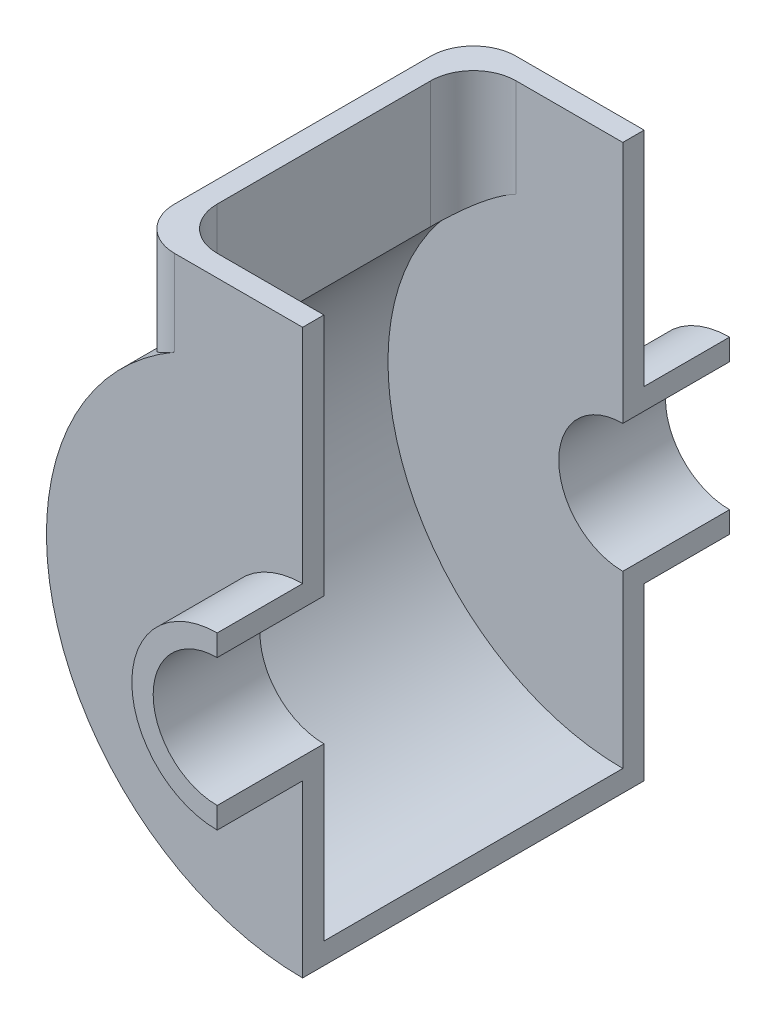
ISO-10303-21;
HEADER;
FILE_DESCRIPTION(('STEP AP214'),'2;1');
FILE_NAME('part.step','',(''),(''),'','','');
FILE_SCHEMA(('AUTOMOTIVE_DESIGN { 1 0 10303 214 1 1 1 1 }'));
ENDSEC;
DATA;
#1=APPLICATION_CONTEXT('core data for automotive mechanical design processes');
#2=APPLICATION_PROTOCOL_DEFINITION('international standard','automotive_design',2000,#1);
#3=PRODUCT_CONTEXT('',#1,'mechanical');
#4=PRODUCT('Part','Part','',(#3));
#5=PRODUCT_RELATED_PRODUCT_CATEGORY('part','',(#4));
#6=PRODUCT_DEFINITION_FORMATION('','',#4);
#7=PRODUCT_DEFINITION_CONTEXT('part definition',#1,'design');
#8=PRODUCT_DEFINITION('design','',#6,#7);
#9=PRODUCT_DEFINITION_SHAPE('','',#8);
#10=(LENGTH_UNIT() NAMED_UNIT(*) SI_UNIT(.MILLI.,.METRE.));
#11=(NAMED_UNIT(*) PLANE_ANGLE_UNIT() SI_UNIT($,.RADIAN.));
#12=(NAMED_UNIT(*) SI_UNIT($,.STERADIAN.) SOLID_ANGLE_UNIT());
#13=UNCERTAINTY_MEASURE_WITH_UNIT(LENGTH_MEASURE(1.E-05),#10,'distance_accuracy_value','');
#14=(GEOMETRIC_REPRESENTATION_CONTEXT(3) GLOBAL_UNCERTAINTY_ASSIGNED_CONTEXT((#13)) GLOBAL_UNIT_ASSIGNED_CONTEXT((#10,
#11,#12)) REPRESENTATION_CONTEXT('',''));
#15=CARTESIAN_POINT('',(0.,0.,0.));
#16=DIRECTION('',(0.,0.,1.));
#17=DIRECTION('',(1.,0.,0.));
#18=AXIS2_PLACEMENT_3D('',#15,#16,#17);
#19=CARTESIAN_POINT('',(0.,0.,0.));
#20=DIRECTION('',(0.,0.,1.));
#21=DIRECTION('',(1.,0.,0.));
#22=AXIS2_PLACEMENT_3D('',#19,#20,#21);
#23=PLANE('',#22);
#24=CARTESIAN_POINT('',(0.,0.,0.));
#25=DIRECTION('',(0.,0.,1.));
#26=DIRECTION('',(1.,0.,0.));
#27=AXIS2_PLACEMENT_3D('',#24,#25,#26);
#28=CIRCLE('',#27,55.);
#29=CARTESIAN_POINT('',(-25.,48.9897948556636,0.));
#30=VERTEX_POINT('',#29);
#31=CARTESIAN_POINT('',(0.,-55.,0.));
#32=VERTEX_POINT('',#31);
#33=EDGE_CURVE('E71',#30,#32,#28,.T.);
#34=ORIENTED_EDGE('',*,*,#33,.F.);
#35=DIRECTION('',(0.,-1.,0.));
#36=VECTOR('',#35,1.);
#37=CARTESIAN_POINT('',(-25.,72.,0.));
#38=LINE('',#37,#36);
#39=CARTESIAN_POINT('',(-25.,72.,0.));
#40=VERTEX_POINT('',#39);
#41=EDGE_CURVE('E328',#30,#40,#38,.F.);
#42=ORIENTED_EDGE('',*,*,#41,.T.);
#43=DIRECTION('',(-1.,0.,0.));
#44=VECTOR('',#43,1.);
#45=CARTESIAN_POINT('',(0.,72.,0.));
#46=LINE('',#45,#44);
#47=CARTESIAN_POINT('',(0.,72.,0.));
#48=VERTEX_POINT('',#47);
#49=EDGE_CURVE('E265',#48,#40,#46,.T.);
#50=ORIENTED_EDGE('',*,*,#49,.F.);
#51=DIRECTION('',(0.,1.,0.));
#52=VECTOR('',#51,1.);
#53=CARTESIAN_POINT('',(0.,20.,0.));
#54=LINE('',#53,#52);
#55=CARTESIAN_POINT('',(0.,15.,0.));
#56=VERTEX_POINT('',#55);
#57=EDGE_CURVE('E298',#56,#48,#54,.T.);
#58=ORIENTED_EDGE('',*,*,#57,.F.);
#59=CARTESIAN_POINT('',(0.,0.,0.));
#60=DIRECTION('',(0.,0.,-1.));
#61=DIRECTION('',(1.,0.,0.));
#62=AXIS2_PLACEMENT_3D('',#59,#60,#61);
#63=CIRCLE('',#62,15.);
#64=CARTESIAN_POINT('',(0.,-15.,0.));
#65=VERTEX_POINT('',#64);
#66=EDGE_CURVE('E284',#65,#56,#63,.T.);
#67=ORIENTED_EDGE('',*,*,#66,.F.);
#68=DIRECTION('',(0.,1.,0.));
#69=VECTOR('',#68,1.);
#70=CARTESIAN_POINT('',(0.,-15.,0.));
#71=LINE('',#70,#69);
#72=EDGE_CURVE('E289',#32,#65,#71,.T.);
#73=ORIENTED_EDGE('',*,*,#72,.F.);
#74=EDGE_LOOP('',(#34,#42,#50,#58,#67,#73));
#75=FACE_BOUND('',#74,.T.);
#76=ADVANCED_FACE('F43',(#75),#23,.F.);
#77=CARTESIAN_POINT('',(0.,0.,25.));
#78=DIRECTION('',(0.,0.,-1.));
#79=DIRECTION('',(-1.,0.,0.));
#80=AXIS2_PLACEMENT_3D('',#77,#78,#79);
#81=CYLINDRICAL_SURFACE('',#80,20.);
#82=CARTESIAN_POINT('',(0.,0.,5.));
#83=DIRECTION('',(0.,0.,-1.));
#84=DIRECTION('',(-1.,0.,0.));
#85=AXIS2_PLACEMENT_3D('',#82,#83,#84);
#86=CIRCLE('',#85,20.);
#87=CARTESIAN_POINT('',(0.,-20.,5.));
#88=VERTEX_POINT('',#87);
#89=CARTESIAN_POINT('',(0.,20.,5.));
#90=VERTEX_POINT('',#89);
#91=EDGE_CURVE('E281',#88,#90,#86,.T.);
#92=ORIENTED_EDGE('',*,*,#91,.F.);
#93=DIRECTION('',(0.,0.,-1.));
#94=VECTOR('',#93,1.);
#95=CARTESIAN_POINT('',(0.,-20.,25.));
#96=LINE('',#95,#94);
#97=CARTESIAN_POINT('',(0.,-20.,25.));
#98=VERTEX_POINT('',#97);
#99=EDGE_CURVE('E303',#98,#88,#96,.T.);
#100=ORIENTED_EDGE('',*,*,#99,.F.);
#101=CARTESIAN_POINT('',(0.,0.,25.));
#102=DIRECTION('',(0.,0.,1.));
#103=DIRECTION('',(1.,0.,0.));
#104=AXIS2_PLACEMENT_3D('',#101,#102,#103);
#105=CIRCLE('',#104,20.);
#106=CARTESIAN_POINT('',(0.,20.,25.));
#107=VERTEX_POINT('',#106);
#108=EDGE_CURVE('E291',#107,#98,#105,.T.);
#109=ORIENTED_EDGE('',*,*,#108,.F.);
#110=DIRECTION('',(0.,0.,-1.));
#111=VECTOR('',#110,1.);
#112=CARTESIAN_POINT('',(0.,20.,25.));
#113=LINE('',#112,#111);
#114=EDGE_CURVE('E305',#107,#90,#113,.T.);
#115=ORIENTED_EDGE('',*,*,#114,.T.);
#116=EDGE_LOOP('',(#92,#100,#109,#115));
#117=FACE_BOUND('',#116,.T.);
#118=ADVANCED_FACE('F397',(#117),#81,.T.);
#119=CARTESIAN_POINT('',(0.,0.,25.));
#120=DIRECTION('',(0.,0.,-1.));
#121=DIRECTION('',(-1.,0.,0.));
#122=AXIS2_PLACEMENT_3D('',#119,#120,#121);
#123=CYLINDRICAL_SURFACE('',#122,15.);
#124=ORIENTED_EDGE('',*,*,#66,.T.);
#125=DIRECTION('',(0.,0.,-1.));
#126=VECTOR('',#125,1.);
#127=CARTESIAN_POINT('',(0.,15.,25.));
#128=LINE('',#127,#126);
#129=CARTESIAN_POINT('',(0.,15.,25.));
#130=VERTEX_POINT('',#129);
#131=EDGE_CURVE('E307',#130,#56,#128,.T.);
#132=ORIENTED_EDGE('',*,*,#131,.F.);
#133=CARTESIAN_POINT('',(0.,0.,25.));
#134=DIRECTION('',(0.,0.,-1.));
#135=DIRECTION('',(1.,0.,0.));
#136=AXIS2_PLACEMENT_3D('',#133,#134,#135);
#137=CIRCLE('',#136,15.);
#138=CARTESIAN_POINT('',(0.,-15.,25.));
#139=VERTEX_POINT('',#138);
#140=EDGE_CURVE('E285',#139,#130,#137,.T.);
#141=ORIENTED_EDGE('',*,*,#140,.F.);
#142=DIRECTION('',(0.,0.,-1.));
#143=VECTOR('',#142,1.);
#144=CARTESIAN_POINT('',(0.,-15.,25.));
#145=LINE('',#144,#143);
#146=EDGE_CURVE('E295',#139,#65,#145,.T.);
#147=ORIENTED_EDGE('',*,*,#146,.T.);
#148=EDGE_LOOP('',(#124,#132,#141,#147));
#149=FACE_BOUND('',#148,.T.);
#150=ADVANCED_FACE('F356',(#149),#123,.F.);
#151=CARTESIAN_POINT('',(0.,20.,25.));
#152=DIRECTION('',(-1.,0.,0.));
#153=DIRECTION('',(0.,-1.,0.));
#154=AXIS2_PLACEMENT_3D('',#151,#152,#153);
#155=PLANE('',#154);
#156=ORIENTED_EDGE('',*,*,#57,.T.);
#157=DIRECTION('',(0.,0.,-1.));
#158=VECTOR('',#157,1.);
#159=CARTESIAN_POINT('',(0.,72.,5.));
#160=LINE('',#159,#158);
#161=CARTESIAN_POINT('',(0.,72.,5.));
#162=VERTEX_POINT('',#161);
#163=EDGE_CURVE('E195',#162,#48,#160,.T.);
#164=ORIENTED_EDGE('',*,*,#163,.F.);
#165=DIRECTION('',(0.,1.,0.));
#166=VECTOR('',#165,1.);
#167=CARTESIAN_POINT('',(0.,15.,5.));
#168=LINE('',#167,#166);
#169=EDGE_CURVE('E271',#90,#162,#168,.T.);
#170=ORIENTED_EDGE('',*,*,#169,.F.);
#171=ORIENTED_EDGE('',*,*,#114,.F.);
#172=DIRECTION('',(0.,1.,0.));
#173=VECTOR('',#172,1.);
#174=CARTESIAN_POINT('',(0.,20.,25.));
#175=LINE('',#174,#173);
#176=EDGE_CURVE('E288',#130,#107,#175,.T.);
#177=ORIENTED_EDGE('',*,*,#176,.F.);
#178=ORIENTED_EDGE('',*,*,#131,.T.);
#179=EDGE_LOOP('',(#156,#164,#170,#171,#177,#178));
#180=FACE_BOUND('',#179,.T.);
#181=ADVANCED_FACE('F407',(#180),#155,.F.);
#182=CARTESIAN_POINT('',(0.,-15.,25.));
#183=DIRECTION('',(-1.,0.,0.));
#184=DIRECTION('',(0.,0.,1.));
#185=AXIS2_PLACEMENT_3D('',#182,#183,#184);
#186=PLANE('',#185);
#187=DIRECTION('',(0.,0.,-1.));
#188=VECTOR('',#187,1.);
#189=CARTESIAN_POINT('',(0.,-60.,5.));
#190=LINE('',#189,#188);
#191=CARTESIAN_POINT('',(0.,-60.,5.));
#192=VERTEX_POINT('',#191);
#193=CARTESIAN_POINT('',(0.,-60.,-75.));
#194=VERTEX_POINT('',#193);
#195=EDGE_CURVE('E184',#192,#194,#190,.T.);
#196=ORIENTED_EDGE('',*,*,#195,.T.);
#197=DIRECTION('',(0.,1.,0.));
#198=VECTOR('',#197,1.);
#199=CARTESIAN_POINT('',(0.,-20.,-75.));
#200=LINE('',#199,#198);
#201=CARTESIAN_POINT('',(0.,-20.,-75.));
#202=VERTEX_POINT('',#201);
#203=EDGE_CURVE('E189',#194,#202,#200,.T.);
#204=ORIENTED_EDGE('',*,*,#203,.T.);
#205=DIRECTION('',(0.,0.,1.));
#206=VECTOR('',#205,1.);
#207=CARTESIAN_POINT('',(0.,-20.,-95.));
#208=LINE('',#207,#206);
#209=CARTESIAN_POINT('',(0.,-20.,-95.));
#210=VERTEX_POINT('',#209);
#211=EDGE_CURVE('E244',#210,#202,#208,.T.);
#212=ORIENTED_EDGE('',*,*,#211,.F.);
#213=DIRECTION('',(0.,1.,0.));
#214=VECTOR('',#213,1.);
#215=CARTESIAN_POINT('',(0.,-15.,-95.));
#216=LINE('',#215,#214);
#217=CARTESIAN_POINT('',(0.,-15.,-95.));
#218=VERTEX_POINT('',#217);
#219=EDGE_CURVE('E233',#210,#218,#216,.T.);
#220=ORIENTED_EDGE('',*,*,#219,.T.);
#221=DIRECTION('',(0.,0.,1.));
#222=VECTOR('',#221,1.);
#223=CARTESIAN_POINT('',(0.,-15.,-95.));
#224=LINE('',#223,#222);
#225=CARTESIAN_POINT('',(0.,-15.,-70.));
#226=VERTEX_POINT('',#225);
#227=EDGE_CURVE('E235',#218,#226,#224,.T.);
#228=ORIENTED_EDGE('',*,*,#227,.T.);
#229=DIRECTION('',(0.,1.,0.));
#230=VECTOR('',#229,1.);
#231=CARTESIAN_POINT('',(0.,-15.,-70.));
#232=LINE('',#231,#230);
#233=CARTESIAN_POINT('',(0.,-55.,-70.));
#234=VERTEX_POINT('',#233);
#235=EDGE_CURVE('E228',#234,#226,#232,.T.);
#236=ORIENTED_EDGE('',*,*,#235,.F.);
#237=DIRECTION('',(0.,0.,1.));
#238=VECTOR('',#237,1.);
#239=CARTESIAN_POINT('',(0.,-55.,-95.002));
#240=LINE('',#239,#238);
#241=EDGE_CURVE('E254',#234,#32,#240,.T.);
#242=ORIENTED_EDGE('',*,*,#241,.T.);
#243=ORIENTED_EDGE('',*,*,#72,.T.);
#244=ORIENTED_EDGE('',*,*,#146,.F.);
#245=DIRECTION('',(0.,1.,0.));
#246=VECTOR('',#245,1.);
#247=CARTESIAN_POINT('',(0.,-15.,25.));
#248=LINE('',#247,#246);
#249=EDGE_CURVE('E293',#98,#139,#248,.T.);
#250=ORIENTED_EDGE('',*,*,#249,.F.);
#251=ORIENTED_EDGE('',*,*,#99,.T.);
#252=DIRECTION('',(0.,1.,0.));
#253=VECTOR('',#252,1.);
#254=CARTESIAN_POINT('',(0.,-20.,5.));
#255=LINE('',#254,#253);
#256=EDGE_CURVE('E193',#192,#88,#255,.T.);
#257=ORIENTED_EDGE('',*,*,#256,.F.);
#258=EDGE_LOOP('',(#196,#204,#212,#220,#228,#236,#242,#243,#244,#250,#251,#257));
#259=FACE_BOUND('',#258,.T.);
#260=ADVANCED_FACE('F186',(#259),#186,.F.);
#261=CARTESIAN_POINT('',(0.,0.,25.));
#262=DIRECTION('',(0.,0.,1.));
#263=DIRECTION('',(1.,0.,0.));
#264=AXIS2_PLACEMENT_3D('',#261,#262,#263);
#265=PLANE('',#264);
#266=ORIENTED_EDGE('',*,*,#140,.T.);
#267=ORIENTED_EDGE('',*,*,#176,.T.);
#268=ORIENTED_EDGE('',*,*,#108,.T.);
#269=ORIENTED_EDGE('',*,*,#249,.T.);
#270=EDGE_LOOP('',(#266,#267,#268,#269));
#271=FACE_BOUND('',#270,.T.);
#272=ADVANCED_FACE('F384',(#271),#265,.T.);
#273=CARTESIAN_POINT('',(0.,0.,5.));
#274=DIRECTION('',(0.,0.,-1.));
#275=DIRECTION('',(-1.,0.,0.));
#276=AXIS2_PLACEMENT_3D('',#273,#274,#275);
#277=PLANE('',#276);
#278=DIRECTION('',(-1.,0.,0.));
#279=VECTOR('',#278,1.);
#280=CARTESIAN_POINT('',(0.,72.,5.));
#281=LINE('',#280,#279);
#282=CARTESIAN_POINT('',(-30.,72.,5.));
#283=VERTEX_POINT('',#282);
#284=EDGE_CURVE('E266',#162,#283,#281,.T.);
#285=ORIENTED_EDGE('',*,*,#284,.T.);
#286=DIRECTION('',(0.,-1.,0.));
#287=VECTOR('',#286,1.);
#288=CARTESIAN_POINT('',(-30.,0.,5.));
#289=LINE('',#288,#287);
#290=CARTESIAN_POINT('',(-30.,51.9615242270663,5.));
#291=VERTEX_POINT('',#290);
#292=EDGE_CURVE('E330',#283,#291,#289,.T.);
#293=ORIENTED_EDGE('',*,*,#292,.T.);
#294=CARTESIAN_POINT('',(0.,0.,5.));
#295=DIRECTION('',(0.,0.,1.));
#296=DIRECTION('',(-1.,0.,0.));
#297=AXIS2_PLACEMENT_3D('',#294,#295,#296);
#298=CIRCLE('',#297,60.);
#299=EDGE_CURVE('E63',#291,#192,#298,.T.);
#300=ORIENTED_EDGE('',*,*,#299,.T.);
#301=ORIENTED_EDGE('',*,*,#256,.T.);
#302=ORIENTED_EDGE('',*,*,#91,.T.);
#303=ORIENTED_EDGE('',*,*,#169,.T.);
#304=EDGE_LOOP('',(#285,#293,#300,#301,#302,#303));
#305=FACE_BOUND('',#304,.T.);
#306=ADVANCED_FACE('F380',(#305),#277,.F.);
#307=CARTESIAN_POINT('',(0.,72.,5.));
#308=DIRECTION('',(0.,-1.,0.));
#309=DIRECTION('',(1.,0.,0.));
#310=AXIS2_PLACEMENT_3D('',#307,#308,#309);
#311=PLANE('',#310);
#312=DIRECTION('',(-1.,0.,0.));
#313=VECTOR('',#312,1.);
#314=CARTESIAN_POINT('',(0.,72.,-75.));
#315=LINE('',#314,#313);
#316=CARTESIAN_POINT('',(0.,72.,-75.));
#317=VERTEX_POINT('',#316);
#318=CARTESIAN_POINT('',(-30.,72.,-75.));
#319=VERTEX_POINT('',#318);
#320=EDGE_CURVE('E204',#317,#319,#315,.T.);
#321=ORIENTED_EDGE('',*,*,#320,.T.);
#322=CARTESIAN_POINT('',(-30.,72.,-65.));
#323=DIRECTION('',(0.,-1.,0.));
#324=DIRECTION('',(1.,0.,0.));
#325=AXIS2_PLACEMENT_3D('',#322,#323,#324);
#326=CIRCLE('',#325,10.);
#327=CARTESIAN_POINT('',(-40.,72.,-65.));
#328=VERTEX_POINT('',#327);
#329=EDGE_CURVE('E318',#319,#328,#326,.F.);
#330=ORIENTED_EDGE('',*,*,#329,.T.);
#331=DIRECTION('',(0.,0.,-1.));
#332=VECTOR('',#331,1.);
#333=CARTESIAN_POINT('',(-40.,72.,5.));
#334=LINE('',#333,#332);
#335=CARTESIAN_POINT('',(-40.,72.,-5.));
#336=VERTEX_POINT('',#335);
#337=EDGE_CURVE('E278',#336,#328,#334,.T.);
#338=ORIENTED_EDGE('',*,*,#337,.F.);
#339=CARTESIAN_POINT('',(-30.,72.,-5.));
#340=DIRECTION('',(0.,-1.,0.));
#341=DIRECTION('',(1.,0.,0.));
#342=AXIS2_PLACEMENT_3D('',#339,#340,#341);
#343=CIRCLE('',#342,10.);
#344=EDGE_CURVE('E316',#336,#283,#343,.F.);
#345=ORIENTED_EDGE('',*,*,#344,.T.);
#346=ORIENTED_EDGE('',*,*,#284,.F.);
#347=ORIENTED_EDGE('',*,*,#163,.T.);
#348=ORIENTED_EDGE('',*,*,#49,.T.);
#349=CARTESIAN_POINT('',(-25.,72.,-9.99999999999999));
#350=DIRECTION('',(0.,-1.,0.));
#351=DIRECTION('',(1.,0.,0.));
#352=AXIS2_PLACEMENT_3D('',#349,#350,#351);
#353=CIRCLE('',#352,10.);
#354=CARTESIAN_POINT('',(-35.,72.,-9.99999999999999));
#355=VERTEX_POINT('',#354);
#356=EDGE_CURVE('E57',#40,#355,#353,.T.);
#357=ORIENTED_EDGE('',*,*,#356,.T.);
#358=DIRECTION('',(0.,0.,1.));
#359=VECTOR('',#358,1.);
#360=CARTESIAN_POINT('',(-35.,72.,-95.002));
#361=LINE('',#360,#359);
#362=CARTESIAN_POINT('',(-35.,72.,-60.));
#363=VERTEX_POINT('',#362);
#364=EDGE_CURVE('E253',#363,#355,#361,.T.);
#365=ORIENTED_EDGE('',*,*,#364,.F.);
#366=CARTESIAN_POINT('',(-25.,72.,-60.));
#367=DIRECTION('',(0.,-1.,0.));
#368=DIRECTION('',(1.,0.,0.));
#369=AXIS2_PLACEMENT_3D('',#366,#367,#368);
#370=CIRCLE('',#369,10.);
#371=CARTESIAN_POINT('',(-25.,72.,-70.));
#372=VERTEX_POINT('',#371);
#373=EDGE_CURVE('E371',#363,#372,#370,.T.);
#374=ORIENTED_EDGE('',*,*,#373,.T.);
#375=DIRECTION('',(-1.,0.,0.));
#376=VECTOR('',#375,1.);
#377=CARTESIAN_POINT('',(0.,72.,-70.));
#378=LINE('',#377,#376);
#379=CARTESIAN_POINT('',(0.,72.,-70.));
#380=VERTEX_POINT('',#379);
#381=EDGE_CURVE('E217',#380,#372,#378,.T.);
#382=ORIENTED_EDGE('',*,*,#381,.F.);
#383=DIRECTION('',(0.,0.,1.));
#384=VECTOR('',#383,1.);
#385=CARTESIAN_POINT('',(0.,72.,-75.));
#386=LINE('',#385,#384);
#387=EDGE_CURVE('E213',#317,#380,#386,.T.);
#388=ORIENTED_EDGE('',*,*,#387,.F.);
#389=EDGE_LOOP('',(#321,#330,#338,#345,#346,#347,#348,#357,#365,#374,#382,#388));
#390=FACE_BOUND('',#389,.T.);
#391=ADVANCED_FACE('F383',(#390),#311,.F.);
#392=CARTESIAN_POINT('',(-40.,72.,5.));
#393=DIRECTION('',(1.,0.,0.));
#394=DIRECTION('',(0.,0.,-1.));
#395=AXIS2_PLACEMENT_3D('',#392,#393,#394);
#396=PLANE('',#395);
#397=ORIENTED_EDGE('',*,*,#337,.T.);
#398=DIRECTION('',(0.,-1.,0.));
#399=VECTOR('',#398,1.);
#400=CARTESIAN_POINT('',(-40.,72.,-65.));
#401=LINE('',#400,#399);
#402=CARTESIAN_POINT('',(-40.,44.7213595499958,-65.));
#403=VERTEX_POINT('',#402);
#404=EDGE_CURVE('E311',#328,#403,#401,.T.);
#405=ORIENTED_EDGE('',*,*,#404,.T.);
#406=DIRECTION('',(0.,0.,-1.));
#407=VECTOR('',#406,1.);
#408=CARTESIAN_POINT('',(-40.,44.7213595499958,5.));
#409=LINE('',#408,#407);
#410=CARTESIAN_POINT('',(-40.,44.7213595499958,-5.));
#411=VERTEX_POINT('',#410);
#412=EDGE_CURVE('E194',#411,#403,#409,.T.);
#413=ORIENTED_EDGE('',*,*,#412,.F.);
#414=DIRECTION('',(0.,-1.,0.));
#415=VECTOR('',#414,1.);
#416=CARTESIAN_POINT('',(-40.,72.,-5.));
#417=LINE('',#416,#415);
#418=EDGE_CURVE('E309',#411,#336,#417,.F.);
#419=ORIENTED_EDGE('',*,*,#418,.T.);
#420=EDGE_LOOP('',(#397,#405,#413,#419));
#421=FACE_BOUND('',#420,.T.);
#422=ADVANCED_FACE('F391',(#421),#396,.F.);
#423=CARTESIAN_POINT('',(0.,0.,5.));
#424=DIRECTION('',(0.,0.,-1.));
#425=DIRECTION('',(-1.,0.,0.));
#426=AXIS2_PLACEMENT_3D('',#423,#424,#425);
#427=CYLINDRICAL_SURFACE('',#426,60.);
#428=ORIENTED_EDGE('',*,*,#299,.F.);
#429=CARTESIAN_POINT('',(-30.,51.9615242270663,5.));
#430=CARTESIAN_POINT('',(-30.1846403402756,51.8549243575684,4.99999694467445));
#431=CARTESIAN_POINT('',(-30.3686755821332,51.7473565843307,4.99488587812623));
#432=CARTESIAN_POINT('',(-30.7351668388072,51.5305231450817,4.97462918627216));
#433=CARTESIAN_POINT('',(-30.9176229894396,51.4212576273974,4.95948443281986));
#434=CARTESIAN_POINT('',(-31.4619253243051,51.0913595980358,4.89929167200636));
#435=CARTESIAN_POINT('',(-31.8209014856786,50.868512343648,4.83948477245505));
#436=CARTESIAN_POINT('',(-32.5288887310146,50.418725257113,4.68176841927459));
#437=CARTESIAN_POINT('',(-32.8778736192083,50.1917768316845,4.5837671788936));
#438=CARTESIAN_POINT('',(-33.562476910193,49.7365966241752,4.35090696893926));
#439=CARTESIAN_POINT('',(-33.8980954977704,49.5083648598862,4.21604850911225));
#440=CARTESIAN_POINT('',(-34.5207296024579,49.0759439346811,3.92574534472068));
#441=CARTESIAN_POINT('',(-34.80925125366,48.8716304811259,3.77370267176126));
#442=CARTESIAN_POINT('',(-35.3716903107987,48.4661085573826,3.44107089228343));
#443=CARTESIAN_POINT('',(-35.6456079007732,48.2649000480893,3.26048214561177));
#444=CARTESIAN_POINT('',(-36.1765727574088,47.8682074936152,2.87135112309205));
#445=CARTESIAN_POINT('',(-36.4336405194033,47.6727166603459,2.66284378257166));
#446=CARTESIAN_POINT('',(-36.9290721152615,47.289972828363,2.21794621899144));
#447=CARTESIAN_POINT('',(-37.167441451851,47.1027174132443,1.98156425075618));
#448=CARTESIAN_POINT('',(-37.565018182153,46.785859634165,1.54478146403292));
#449=CARTESIAN_POINT('',(-37.7289458526818,46.6537017113221,1.35050833176436));
#450=CARTESIAN_POINT('',(-38.043765038696,46.397339573439,0.946710505836681));
#451=CARTESIAN_POINT('',(-38.1946575996422,46.2731347207424,0.737187037795441));
#452=CARTESIAN_POINT('',(-38.4818360085844,46.0345861261904,0.303399948510735));
#453=CARTESIAN_POINT('',(-38.618136880254,45.9202322658759,0.0791518792914349));
#454=CARTESIAN_POINT('',(-38.8746918035924,45.7032445431668,-0.383743447816966));
#455=CARTESIAN_POINT('',(-38.9949492411763,45.6006082084878,-0.622387651960065));
#456=CARTESIAN_POINT('',(-39.1965662504922,45.4273417305266,-1.06669402634215));
#457=CARTESIAN_POINT('',(-39.2809795718102,45.3543309967536,-1.27004581930021));
#458=CARTESIAN_POINT('',(-39.437114382813,45.2186323209963,-1.68488791321455));
#459=CARTESIAN_POINT('',(-39.508838494378,45.1559422467147,-1.89637652189831));
#460=CARTESIAN_POINT('',(-39.6385128100447,45.0421551914612,-2.32617263610176));
#461=CARTESIAN_POINT('',(-39.6964869139818,44.9910381018204,-2.54446755239788));
#462=CARTESIAN_POINT('',(-39.7978943535571,44.9013606141582,-2.986852666006));
#463=CARTESIAN_POINT('',(-39.8413328734582,44.8627957393971,-3.2109407663361));
#464=CARTESIAN_POINT('',(-39.9177189665931,44.7948514731765,-3.69377442824111));
#465=CARTESIAN_POINT('',(-39.9484884415043,44.7673886419263,-3.95314914513774));
#466=CARTESIAN_POINT('',(-39.9793476433001,44.7398248250479,-4.34440444684136));
#467=CARTESIAN_POINT('',(-39.987084921451,44.7329085695169,-4.47527578752074));
#468=CARTESIAN_POINT('',(-39.9974129661721,44.7236736235071,-4.73742237599204));
#469=CARTESIAN_POINT('',(-40.0000021863485,44.7213563144782,-4.86869773328782));
#470=CARTESIAN_POINT('',(-40.,44.7213595499958,-5.));
#471=B_SPLINE_CURVE_WITH_KNOTS('',3,(#429,#430,#431,#432,#433,#434,#435,#436,#437,#438,#439,
#440,#441,#442,#443,#444,#445,#446,#447,#448,#449,#450,#451,#452,#453,#454,#455,#456,#457,#458,
#459,#460,#461,#462,#463,#464,#465,#466,#467,#468,#469,#470),.UNSPECIFIED.,.F.,.F.,(4,2,2,2,2,2,
2,2,2,2,2,2,2,2,2,2,2,2,2,2,4),(0.,0.639469988122812,1.27888441829631,2.55703672344089,
3.83827975129429,5.11950506007104,6.27274736359202,7.42597513070352,8.57777308710979,
9.72923080131073,10.5879927572485,11.4466857734357,12.3044859953459,13.1621048939207,
13.8573439066469,14.5524390989254,15.2463170957639,15.9399473495783,16.7262834977137,
17.1199731890566,17.5137811205932),.UNSPECIFIED.);
#472=EDGE_CURVE('E11',#291,#411,#471,.T.);
#473=ORIENTED_EDGE('',*,*,#472,.T.);
#474=ORIENTED_EDGE('',*,*,#412,.T.);
#475=CARTESIAN_POINT('',(-40.,44.7213595499958,-65.));
#476=CARTESIAN_POINT('',(-40.0000015812733,44.7213573011344,-65.1176634010021));
#477=CARTESIAN_POINT('',(-39.9979227141808,44.7232176305845,-65.2353086549857));
#478=CARTESIAN_POINT('',(-39.9896253110866,44.7306372942271,-65.4703286016599));
#479=CARTESIAN_POINT('',(-39.9834070494192,44.7361963832882,-65.5877033117632));
#480=CARTESIAN_POINT('',(-39.9585923280535,44.7583670958171,-65.9388427467587));
#481=CARTESIAN_POINT('',(-39.9338358355778,44.7804722797486,-66.1718758054602));
#482=CARTESIAN_POINT('',(-39.8686644525486,44.8385042167555,-66.6318691326489));
#483=CARTESIAN_POINT('',(-39.8283855148164,44.8743109465834,-66.8588643223737));
#484=CARTESIAN_POINT('',(-39.7328892662281,44.9588875680342,-67.3072524479117));
#485=CARTESIAN_POINT('',(-39.6776696039361,45.0076595001554,-67.5286444958756));
#486=CARTESIAN_POINT('',(-39.5534118644793,45.116897250534,-67.9636688649734));
#487=CARTESIAN_POINT('',(-39.4844211995899,45.1773229225701,-68.1773249178853));
#488=CARTESIAN_POINT('',(-39.3334605195833,45.3088170177995,-68.5966936542645));
#489=CARTESIAN_POINT('',(-39.2514857085459,45.3798893730022,-68.8024033675523));
#490=CARTESIAN_POINT('',(-39.0753863002099,45.5316122169458,-69.2054529377369));
#491=CARTESIAN_POINT('',(-38.9812363061758,45.6122826978885,-69.4027741200324));
#492=CARTESIAN_POINT('',(-38.7818943790383,45.7818938454653,-69.788046749896));
#493=CARTESIAN_POINT('',(-38.6767013504078,45.8708353325264,-69.9759972651116));
#494=CARTESIAN_POINT('',(-38.4135728743112,46.0916172160901,-70.4129070483267));
#495=CARTESIAN_POINT('',(-38.2509572804996,46.2267600621542,-70.6573967975821));
#496=CARTESIAN_POINT('',(-37.908447036405,46.5080507377657,-71.1270697633622));
#497=CARTESIAN_POINT('',(-37.728551713043,46.6541989959475,-71.3522522271834));
#498=CARTESIAN_POINT('',(-37.3531054007839,46.9553345195759,-71.7833337426989));
#499=CARTESIAN_POINT('',(-37.1575367002328,47.1103317262239,-71.9892103913973));
#500=CARTESIAN_POINT('',(-36.7525951751676,47.4269223387039,-72.3811838692743));
#501=CARTESIAN_POINT('',(-36.543223467163,47.5885152106184,-72.5672822951176));
#502=CARTESIAN_POINT('',(-35.889352420626,48.085927731998,-73.1015951815724));
#503=CARTESIAN_POINT('',(-35.4251261289153,48.429498559668,-73.4189829871174));
#504=CARTESIAN_POINT('',(-34.455372687412,49.1241578823887,-73.9699716496597));
#505=CARTESIAN_POINT('',(-33.9498747171002,49.4752409388269,-74.2036310842669));
#506=CARTESIAN_POINT('',(-33.1568278633415,50.0073212539565,-74.4930456878643));
#507=CARTESIAN_POINT('',(-32.8810021018505,50.1891501210001,-74.5803819665683));
#508=CARTESIAN_POINT('',(-32.3217375725054,50.5511235483305,-74.7310524671282));
#509=CARTESIAN_POINT('',(-32.0382991780871,50.7312681906542,-74.7943878640466));
#510=CARTESIAN_POINT('',(-31.4650006560555,51.0888227050653,-74.8963939978526));
#511=CARTESIAN_POINT('',(-31.1751356203564,51.2662302982853,-74.935045161166));
#512=CARTESIAN_POINT('',(-30.5906934832528,51.6171131325133,-74.9868485137105));
#513=CARTESIAN_POINT('',(-30.2961152167169,51.7905873747387,-74.9999942965489));
#514=CARTESIAN_POINT('',(-30.,51.9615242270663,-75.));
#515=B_SPLINE_CURVE_WITH_KNOTS('',3,(#475,#476,#477,#478,#479,#480,#481,#482,#483,#484,#485,
#486,#487,#488,#489,#490,#491,#492,#493,#494,#495,#496,#497,#498,#499,#500,#501,#502,#503,#504,
#505,#506,#507,#508,#509,#510,#511,#512,#513,#514),.UNSPECIFIED.,.F.,.F.,(4,2,2,2,2,2,2,2,2,2,2,
2,2,2,2,2,2,2,2,4),(0.,0.352921378883199,0.705819370583172,1.41085932128629,2.10985961734753,
2.80896998914977,3.50571366437716,4.20271529673452,4.90119502233958,5.59974410640152,
6.56805788163327,7.53640938987796,8.50587104319841,9.4752543738745,11.444740410353,
13.4128458625582,14.4372042618812,15.4615125030147,16.4866319729198,17.5120088970541),.UNSPECIFIED.);
#516=CARTESIAN_POINT('',(-30.,51.9615242270663,-75.));
#517=VERTEX_POINT('',#516);
#518=EDGE_CURVE('E201',#403,#517,#515,.T.);
#519=ORIENTED_EDGE('',*,*,#518,.T.);
#520=CARTESIAN_POINT('',(0.,0.,-75.));
#521=DIRECTION('',(0.,0.,1.));
#522=DIRECTION('',(-1.,0.,0.));
#523=AXIS2_PLACEMENT_3D('',#520,#521,#522);
#524=CIRCLE('',#523,60.);
#525=EDGE_CURVE('E198',#517,#194,#524,.T.);
#526=ORIENTED_EDGE('',*,*,#525,.T.);
#527=ORIENTED_EDGE('',*,*,#195,.F.);
#528=EDGE_LOOP('',(#428,#473,#474,#519,#526,#527));
#529=FACE_BOUND('',#528,.T.);
#530=ADVANCED_FACE('F199',(#529),#427,.T.);
#531=CARTESIAN_POINT('',(0.,0.,-95.002));
#532=DIRECTION('',(0.,0.,1.));
#533=DIRECTION('',(1.,0.,0.));
#534=AXIS2_PLACEMENT_3D('',#531,#532,#533);
#535=CYLINDRICAL_SURFACE('',#534,55.);
#536=CARTESIAN_POINT('',(0.,0.,-70.));
#537=DIRECTION('',(0.,0.,-1.));
#538=DIRECTION('',(-1.,0.,0.));
#539=AXIS2_PLACEMENT_3D('',#536,#537,#538);
#540=CIRCLE('',#539,55.);
#541=CARTESIAN_POINT('',(-25.,48.9897948556635,-70.));
#542=VERTEX_POINT('',#541);
#543=EDGE_CURVE('E257',#542,#234,#540,.F.);
#544=ORIENTED_EDGE('',*,*,#543,.F.);
#545=CARTESIAN_POINT('',(-25.,48.9897948556636,-70.));
#546=CARTESIAN_POINT('',(-25.1906704625853,48.8924964907343,-69.9999971656189));
#547=CARTESIAN_POINT('',(-25.3807299051036,48.7941008127997,-69.9945462068009));
#548=CARTESIAN_POINT('',(-25.7591946792121,48.5953653194177,-69.9729416657178));
#549=CARTESIAN_POINT('',(-25.947600172291,48.4950256969118,-69.9567891403815));
#550=CARTESIAN_POINT('',(-26.5095199627771,48.1915584402701,-69.8925935595296));
#551=CARTESIAN_POINT('',(-26.879966617226,47.985865462464,-69.8288120264318));
#552=CARTESIAN_POINT('',(-27.6092367230561,47.5700172433392,-69.6608532752705));
#553=CARTESIAN_POINT('',(-27.9680515865194,47.3598588865119,-69.5566469152987));
#554=CARTESIAN_POINT('',(-28.6708870947942,46.9377053718885,-69.3093143170567));
#555=CARTESIAN_POINT('',(-29.0149087495746,46.7257103406777,-69.1661907406623));
#556=CARTESIAN_POINT('',(-29.6343122240442,46.3348745882726,-68.8669502099571));
#557=CARTESIAN_POINT('',(-29.9121762835488,46.1558947290866,-68.7161192793689));
#558=CARTESIAN_POINT('',(-30.453564058984,45.8004938086765,-68.3880155176435));
#559=CARTESIAN_POINT('',(-30.7170889667725,45.6240725356815,-68.210744888747));
#560=CARTESIAN_POINT('',(-31.2277793899634,45.27605554075,-67.8304558145634));
#561=CARTESIAN_POINT('',(-31.4749603097885,45.1044553652141,-67.6274621555615));
#562=CARTESIAN_POINT('',(-31.9512644556701,44.7683103206218,-67.1960491883292));
#563=CARTESIAN_POINT('',(-32.1803914213147,44.60376399371,-66.9676351692916));
#564=CARTESIAN_POINT('',(-32.5724334975713,44.3179704705643,-66.536394282226));
#565=CARTESIAN_POINT('',(-32.7391594522469,44.1948776144083,-66.3382416976568));
#566=CARTESIAN_POINT('',(-33.0586989979014,43.956366411861,-65.9266540781595));
#567=CARTESIAN_POINT('',(-33.2115135789463,43.8409475194751,-65.7132201327334));
#568=CARTESIAN_POINT('',(-33.5016809731426,43.6196131502262,-65.2717299317311));
#569=CARTESIAN_POINT('',(-33.6390478315194,43.5136890586718,-65.0436872596241));
#570=CARTESIAN_POINT('',(-33.8968966266417,43.3131282626193,-64.5735187782177));
#571=CARTESIAN_POINT('',(-34.0173818752135,43.2184893447453,-64.3313957444228));
#572=CARTESIAN_POINT('',(-34.220345560487,43.0578872759331,-63.8775967975981));
#573=CARTESIAN_POINT('',(-34.3057864350373,42.9898029979803,-63.6679931294044));
#574=CARTESIAN_POINT('',(-34.4630420236251,42.8638412603264,-63.2407750890927));
#575=CARTESIAN_POINT('',(-34.534859392632,42.805961812048,-63.023162287697));
#576=CARTESIAN_POINT('',(-34.6638213670323,42.7015968076424,-62.5813588577465));
#577=CARTESIAN_POINT('',(-34.7209903361364,42.6550923381947,-62.357179851681));
#578=CARTESIAN_POINT('',(-34.8199345283325,42.5743613090907,-61.9033665270967));
#579=CARTESIAN_POINT('',(-34.8617157478199,42.5401299669028,-61.6737343708085));
#580=CARTESIAN_POINT('',(-34.9300837462733,42.4840120509156,-61.2045822520297));
#581=CARTESIAN_POINT('',(-34.9562545186649,42.4624636500731,-60.9649596154708));
#582=CARTESIAN_POINT('',(-34.9824752970613,42.4408592306511,-60.6039690758757));
#583=CARTESIAN_POINT('',(-34.9890430057937,42.4354441063026,-60.4833431270819));
#584=CARTESIAN_POINT('',(-34.9978062165354,42.4282167617888,-60.241817657905));
#585=CARTESIAN_POINT('',(-35.0000014553635,42.4264047584974,-60.120918121493));
#586=CARTESIAN_POINT('',(-35.,42.4264068711929,-60.));
#587=B_SPLINE_CURVE_WITH_KNOTS('',3,(#545,#546,#547,#548,#549,#550,#551,#552,#553,#554,#555,
#556,#557,#558,#559,#560,#561,#562,#563,#564,#565,#566,#567,#568,#569,#570,#571,#572,#573,#574,
#575,#576,#577,#578,#579,#580,#581,#582,#583,#584,#585,#586),.UNSPECIFIED.,.F.,.F.,(4,2,2,2,2,2,
2,2,2,2,2,2,2,2,2,2,2,2,2,2,4),(0.,0.642025153546947,1.28398690760974,2.56714249695266,
3.85122482619342,5.13521934832298,6.22394893506148,7.31258788888127,8.40018571330232,
9.4875576637522,10.3469757139952,11.2063325519534,12.0649016266237,12.9233020310802,
13.6317123054177,14.3399843815419,15.0470706749441,15.7538811342204,16.4787715527391,
16.8414339261366,17.2041181277167),.UNSPECIFIED.);
#588=CARTESIAN_POINT('',(-35.,42.4264068711929,-60.));
#589=VERTEX_POINT('',#588);
#590=EDGE_CURVE('E339',#542,#589,#587,.T.);
#591=ORIENTED_EDGE('',*,*,#590,.T.);
#592=DIRECTION('',(0.,0.,1.));
#593=VECTOR('',#592,1.);
#594=CARTESIAN_POINT('',(-35.,42.4264068711929,-95.002));
#595=LINE('',#594,#593);
#596=CARTESIAN_POINT('',(-35.,42.4264068711929,-9.99999999999999));
#597=VERTEX_POINT('',#596);
#598=EDGE_CURVE('E258',#589,#597,#595,.T.);
#599=ORIENTED_EDGE('',*,*,#598,.T.);
#600=CARTESIAN_POINT('',(-35.,42.4264068711929,-9.99999999999999));
#601=CARTESIAN_POINT('',(-35.0000014497964,42.4264047837681,-9.87987310315719));
#602=CARTESIAN_POINT('',(-34.9978348514331,42.4281931348836,-9.75976422715493));
#603=CARTESIAN_POINT('',(-34.9891857816154,42.4353263709232,-9.51981491367695));
#604=CARTESIAN_POINT('',(-34.9827035721487,42.4406710399539,-9.39997446034919));
#605=CARTESIAN_POINT('',(-34.956830452997,42.4619893413881,-9.04141786262552));
#606=CARTESIAN_POINT('',(-34.9310129679865,42.4832473662838,-8.80342910014089));
#607=CARTESIAN_POINT('',(-34.8629816882097,42.5390927002779,-8.33339460407183));
#608=CARTESIAN_POINT('',(-34.8208989195309,42.5735734756723,-8.10131678852097));
#609=CARTESIAN_POINT('',(-34.7210380015034,42.6550543990627,-7.64278126517026));
#610=CARTESIAN_POINT('',(-34.6632576605496,42.702056295168,-7.4163243469495));
#611=CARTESIAN_POINT('',(-34.5330883120893,42.807391745231,-6.97116269404727));
#612=CARTESIAN_POINT('',(-34.4607440027141,42.865690607765,-6.75243659053953));
#613=CARTESIAN_POINT('',(-34.3022805482754,42.9926022625577,-6.32304828482198));
#614=CARTESIAN_POINT('',(-34.2161564051557,43.061218796573,-6.11238904301828));
#615=CARTESIAN_POINT('',(-34.03096608752,43.2077227263221,-5.69966121720984));
#616=CARTESIAN_POINT('',(-33.9318751543174,43.2856278316291,-5.49761007347531));
#617=CARTESIAN_POINT('',(-33.7218564369498,43.4494435165853,-5.10314735561812));
#618=CARTESIAN_POINT('',(-33.610927467307,43.535354897885,-4.91073674975316));
#619=CARTESIAN_POINT('',(-33.3379150398717,43.7449695332966,-4.47123433911837));
#620=CARTESIAN_POINT('',(-33.1713989056376,43.87147497144,-4.22821699400697));
#621=CARTESIAN_POINT('',(-32.820669795309,44.1344729444258,-3.76121521493266));
#622=CARTESIAN_POINT('',(-32.6364569574066,44.2709654012783,-3.53723063237016));
#623=CARTESIAN_POINT('',(-32.2518815980921,44.5519118289509,-3.10846762196947));
#624=CARTESIAN_POINT('',(-32.0515019123395,44.6963742086041,-2.90371011997532));
#625=CARTESIAN_POINT('',(-31.6364068995163,44.9911403692426,-2.5140694607911));
#626=CARTESIAN_POINT('',(-31.4216926181168,45.1414437238107,-2.3291848564877));
#627=CARTESIAN_POINT('',(-30.7527718961723,45.6022087667656,-1.80053893105145));
#628=CARTESIAN_POINT('',(-30.2782224789075,45.9192504365907,-1.48768197760761));
#629=CARTESIAN_POINT('',(-29.2863950159429,46.5580783691839,-0.947634918697291));
#630=CARTESIAN_POINT('',(-28.7691524751348,46.8798605102554,-0.720374486477759));
#631=CARTESIAN_POINT('',(-27.9782964577458,47.3529868290529,-0.449937168922879));
#632=CARTESIAN_POINT('',(-27.71720700781,47.5063120740257,-0.372373069617559));
#633=CARTESIAN_POINT('',(-27.1884092746343,47.8109125009315,-0.238585466265287));
#634=CARTESIAN_POINT('',(-26.9207016309538,47.9621878787861,-0.182359908655268));
#635=CARTESIAN_POINT('',(-26.379727809034,48.2618435343977,-0.0918406003391299));
#636=CARTESIAN_POINT('',(-26.1064574293253,48.4102214444596,-0.0575641135549301));
#637=CARTESIAN_POINT('',(-25.5558838504953,48.703127245693,-0.0116400796050149));
#638=CARTESIAN_POINT('',(-25.2785794886699,48.8476539914468,8.07737825378104E-07));
#639=CARTESIAN_POINT('',(-25.,48.9897948556635,0.));
#640=B_SPLINE_CURVE_WITH_KNOTS('',3,(#600,#601,#602,#603,#604,#605,#606,#607,#608,#609,#610,
#611,#612,#613,#614,#615,#616,#617,#618,#619,#620,#621,#622,#623,#624,#625,#626,#627,#628,#629,
#630,#631,#632,#633,#634,#635,#636,#637,#638,#639),.UNSPECIFIED.,.F.,.F.,(4,2,2,2,2,2,2,2,2,2,2,
2,2,2,2,2,2,2,2,4),(0.,0.360312293922663,0.720602716369276,1.44047421081293,2.15466369102644,
2.86895293355912,3.58108249267799,4.29347093489964,5.00724001410331,5.72108063834975,
6.68154144938631,7.6419947608704,8.60348155414833,9.56489828596205,11.509617073525,
13.4527345617431,14.3897475989406,15.326670437678,16.2643293057158,17.2022640090674),.UNSPECIFIED.);
#641=EDGE_CURVE('E366',#597,#30,#640,.T.);
#642=ORIENTED_EDGE('',*,*,#641,.T.);
#643=ORIENTED_EDGE('',*,*,#33,.T.);
#644=ORIENTED_EDGE('',*,*,#241,.F.);
#645=EDGE_LOOP('',(#544,#591,#599,#642,#643,#644));
#646=FACE_BOUND('',#645,.T.);
#647=ADVANCED_FACE('F372',(#646),#535,.F.);
#648=CARTESIAN_POINT('',(-35.,72.,-95.002));
#649=DIRECTION('',(-1.,0.,0.));
#650=DIRECTION('',(0.,0.,1.));
#651=AXIS2_PLACEMENT_3D('',#648,#649,#650);
#652=PLANE('',#651);
#653=ORIENTED_EDGE('',*,*,#598,.F.);
#654=DIRECTION('',(0.,-1.,0.));
#655=VECTOR('',#654,1.);
#656=CARTESIAN_POINT('',(-35.,72.,-60.));
#657=LINE('',#656,#655);
#658=EDGE_CURVE('E326',#589,#363,#657,.F.);
#659=ORIENTED_EDGE('',*,*,#658,.T.);
#660=ORIENTED_EDGE('',*,*,#364,.T.);
#661=DIRECTION('',(0.,-1.,0.));
#662=VECTOR('',#661,1.);
#663=CARTESIAN_POINT('',(-35.,42.4264068711929,-9.99999999999999));
#664=LINE('',#663,#662);
#665=EDGE_CURVE('E323',#355,#597,#664,.T.);
#666=ORIENTED_EDGE('',*,*,#665,.T.);
#667=EDGE_LOOP('',(#653,#659,#660,#666));
#668=FACE_BOUND('',#667,.T.);
#669=ADVANCED_FACE('F376',(#668),#652,.F.);
#670=CARTESIAN_POINT('',(0.,0.,-70.));
#671=DIRECTION('',(0.,0.,-1.));
#672=DIRECTION('',(1.,0.,0.));
#673=AXIS2_PLACEMENT_3D('',#670,#671,#672);
#674=PLANE('',#673);
#675=ORIENTED_EDGE('',*,*,#381,.T.);
#676=DIRECTION('',(0.,-1.,0.));
#677=VECTOR('',#676,1.);
#678=CARTESIAN_POINT('',(-25.,42.4264068711929,-70.));
#679=LINE('',#678,#677);
#680=EDGE_CURVE('E320',#372,#542,#679,.T.);
#681=ORIENTED_EDGE('',*,*,#680,.T.);
#682=ORIENTED_EDGE('',*,*,#543,.T.);
#683=ORIENTED_EDGE('',*,*,#235,.T.);
#684=CARTESIAN_POINT('',(0.,0.,-70.));
#685=DIRECTION('',(0.,0.,-1.));
#686=DIRECTION('',(1.,0.,0.));
#687=AXIS2_PLACEMENT_3D('',#684,#685,#686);
#688=CIRCLE('',#687,15.);
#689=CARTESIAN_POINT('',(0.,15.,-70.));
#690=VERTEX_POINT('',#689);
#691=EDGE_CURVE('E223',#226,#690,#688,.T.);
#692=ORIENTED_EDGE('',*,*,#691,.T.);
#693=DIRECTION('',(0.,1.,0.));
#694=VECTOR('',#693,1.);
#695=CARTESIAN_POINT('',(0.,20.,-70.));
#696=LINE('',#695,#694);
#697=EDGE_CURVE('E238',#690,#380,#696,.T.);
#698=ORIENTED_EDGE('',*,*,#697,.T.);
#699=EDGE_LOOP('',(#675,#681,#682,#683,#692,#698));
#700=FACE_BOUND('',#699,.T.);
#701=ADVANCED_FACE('F378',(#700),#674,.F.);
#702=CARTESIAN_POINT('',(0.,0.,-95.));
#703=DIRECTION('',(0.,0.,1.));
#704=DIRECTION('',(-1.,0.,0.));
#705=AXIS2_PLACEMENT_3D('',#702,#703,#704);
#706=CYLINDRICAL_SURFACE('',#705,20.);
#707=CARTESIAN_POINT('',(0.,0.,-75.));
#708=DIRECTION('',(0.,0.,-1.));
#709=DIRECTION('',(-1.,0.,0.));
#710=AXIS2_PLACEMENT_3D('',#707,#708,#709);
#711=CIRCLE('',#710,20.);
#712=CARTESIAN_POINT('',(0.,20.,-75.));
#713=VERTEX_POINT('',#712);
#714=EDGE_CURVE('E209',#202,#713,#711,.T.);
#715=ORIENTED_EDGE('',*,*,#714,.T.);
#716=DIRECTION('',(0.,0.,1.));
#717=VECTOR('',#716,1.);
#718=CARTESIAN_POINT('',(0.,20.,-95.));
#719=LINE('',#718,#717);
#720=CARTESIAN_POINT('',(0.,20.,-95.));
#721=VERTEX_POINT('',#720);
#722=EDGE_CURVE('E246',#721,#713,#719,.T.);
#723=ORIENTED_EDGE('',*,*,#722,.F.);
#724=CARTESIAN_POINT('',(0.,0.,-95.));
#725=DIRECTION('',(0.,0.,1.));
#726=DIRECTION('',(1.,0.,0.));
#727=AXIS2_PLACEMENT_3D('',#724,#725,#726);
#728=CIRCLE('',#727,20.);
#729=EDGE_CURVE('E230',#721,#210,#728,.T.);
#730=ORIENTED_EDGE('',*,*,#729,.T.);
#731=ORIENTED_EDGE('',*,*,#211,.T.);
#732=EDGE_LOOP('',(#715,#723,#730,#731));
#733=FACE_BOUND('',#732,.T.);
#734=ADVANCED_FACE('F534',(#733),#706,.T.);
#735=CARTESIAN_POINT('',(0.,0.,-95.));
#736=DIRECTION('',(0.,0.,1.));
#737=DIRECTION('',(-1.,0.,0.));
#738=AXIS2_PLACEMENT_3D('',#735,#736,#737);
#739=CYLINDRICAL_SURFACE('',#738,15.);
#740=ORIENTED_EDGE('',*,*,#691,.F.);
#741=ORIENTED_EDGE('',*,*,#227,.F.);
#742=CARTESIAN_POINT('',(0.,0.,-95.));
#743=DIRECTION('',(0.,0.,-1.));
#744=DIRECTION('',(1.,0.,0.));
#745=AXIS2_PLACEMENT_3D('',#742,#743,#744);
#746=CIRCLE('',#745,15.);
#747=CARTESIAN_POINT('',(0.,15.,-95.));
#748=VERTEX_POINT('',#747);
#749=EDGE_CURVE('E224',#218,#748,#746,.T.);
#750=ORIENTED_EDGE('',*,*,#749,.T.);
#751=DIRECTION('',(0.,0.,1.));
#752=VECTOR('',#751,1.);
#753=CARTESIAN_POINT('',(0.,15.,-95.));
#754=LINE('',#753,#752);
#755=EDGE_CURVE('E249',#748,#690,#754,.T.);
#756=ORIENTED_EDGE('',*,*,#755,.T.);
#757=EDGE_LOOP('',(#740,#741,#750,#756));
#758=FACE_BOUND('',#757,.T.);
#759=ADVANCED_FACE('F438',(#758),#739,.F.);
#760=CARTESIAN_POINT('',(0.,20.,-95.));
#761=DIRECTION('',(-1.,0.,0.));
#762=DIRECTION('',(0.,-1.,0.));
#763=AXIS2_PLACEMENT_3D('',#760,#761,#762);
#764=PLANE('',#763);
#765=ORIENTED_EDGE('',*,*,#697,.F.);
#766=ORIENTED_EDGE('',*,*,#755,.F.);
#767=DIRECTION('',(0.,1.,0.));
#768=VECTOR('',#767,1.);
#769=CARTESIAN_POINT('',(0.,20.,-95.));
#770=LINE('',#769,#768);
#771=EDGE_CURVE('E227',#748,#721,#770,.T.);
#772=ORIENTED_EDGE('',*,*,#771,.T.);
#773=ORIENTED_EDGE('',*,*,#722,.T.);
#774=DIRECTION('',(0.,1.,0.));
#775=VECTOR('',#774,1.);
#776=CARTESIAN_POINT('',(0.,15.,-75.));
#777=LINE('',#776,#775);
#778=EDGE_CURVE('E210',#713,#317,#777,.T.);
#779=ORIENTED_EDGE('',*,*,#778,.T.);
#780=ORIENTED_EDGE('',*,*,#387,.T.);
#781=EDGE_LOOP('',(#765,#766,#772,#773,#779,#780));
#782=FACE_BOUND('',#781,.T.);
#783=ADVANCED_FACE('F441',(#782),#764,.F.);
#784=CARTESIAN_POINT('',(0.,0.,-95.));
#785=DIRECTION('',(0.,0.,-1.));
#786=DIRECTION('',(1.,0.,0.));
#787=AXIS2_PLACEMENT_3D('',#784,#785,#786);
#788=PLANE('',#787);
#789=ORIENTED_EDGE('',*,*,#749,.F.);
#790=ORIENTED_EDGE('',*,*,#219,.F.);
#791=ORIENTED_EDGE('',*,*,#729,.F.);
#792=ORIENTED_EDGE('',*,*,#771,.F.);
#793=EDGE_LOOP('',(#789,#790,#791,#792));
#794=FACE_BOUND('',#793,.T.);
#795=ADVANCED_FACE('F508',(#794),#788,.T.);
#796=CARTESIAN_POINT('',(0.,0.,-75.));
#797=DIRECTION('',(0.,0.,1.));
#798=DIRECTION('',(-1.,0.,0.));
#799=AXIS2_PLACEMENT_3D('',#796,#797,#798);
#800=PLANE('',#799);
#801=ORIENTED_EDGE('',*,*,#525,.F.);
#802=DIRECTION('',(0.,-1.,0.));
#803=VECTOR('',#802,1.);
#804=CARTESIAN_POINT('',(-30.,0.,-75.));
#805=LINE('',#804,#803);
#806=EDGE_CURVE('E314',#517,#319,#805,.F.);
#807=ORIENTED_EDGE('',*,*,#806,.T.);
#808=ORIENTED_EDGE('',*,*,#320,.F.);
#809=ORIENTED_EDGE('',*,*,#778,.F.);
#810=ORIENTED_EDGE('',*,*,#714,.F.);
#811=ORIENTED_EDGE('',*,*,#203,.F.);
#812=EDGE_LOOP('',(#801,#807,#808,#809,#810,#811));
#813=FACE_BOUND('',#812,.T.);
#814=ADVANCED_FACE('F207',(#813),#800,.F.);
#815=CARTESIAN_POINT('',(-30.,72.,-65.));
#816=DIRECTION('',(0.,-1.,0.));
#817=DIRECTION('',(0.,0.,-1.));
#818=AXIS2_PLACEMENT_3D('',#815,#816,#817);
#819=CYLINDRICAL_SURFACE('',#818,10.);
#820=ORIENTED_EDGE('',*,*,#329,.F.);
#821=ORIENTED_EDGE('',*,*,#806,.F.);
#822=ORIENTED_EDGE('',*,*,#518,.F.);
#823=ORIENTED_EDGE('',*,*,#404,.F.);
#824=EDGE_LOOP('',(#820,#821,#822,#823));
#825=FACE_BOUND('',#824,.T.);
#826=ADVANCED_FACE('F350',(#825),#819,.T.);
#827=CARTESIAN_POINT('',(-25.,0.,-60.));
#828=DIRECTION('',(0.,1.,0.));
#829=DIRECTION('',(0.,0.,1.));
#830=AXIS2_PLACEMENT_3D('',#827,#828,#829);
#831=CYLINDRICAL_SURFACE('',#830,10.);
#832=ORIENTED_EDGE('',*,*,#373,.F.);
#833=ORIENTED_EDGE('',*,*,#658,.F.);
#834=ORIENTED_EDGE('',*,*,#590,.F.);
#835=ORIENTED_EDGE('',*,*,#680,.F.);
#836=EDGE_LOOP('',(#832,#833,#834,#835));
#837=FACE_BOUND('',#836,.T.);
#838=ADVANCED_FACE('F354',(#837),#831,.F.);
#839=CARTESIAN_POINT('',(-25.,72.,-9.99999999999999));
#840=DIRECTION('',(0.,1.,0.));
#841=DIRECTION('',(0.,0.,1.));
#842=AXIS2_PLACEMENT_3D('',#839,#840,#841);
#843=CYLINDRICAL_SURFACE('',#842,10.);
#844=ORIENTED_EDGE('',*,*,#356,.F.);
#845=ORIENTED_EDGE('',*,*,#41,.F.);
#846=ORIENTED_EDGE('',*,*,#641,.F.);
#847=ORIENTED_EDGE('',*,*,#665,.F.);
#848=EDGE_LOOP('',(#844,#845,#846,#847));
#849=FACE_BOUND('',#848,.T.);
#850=ADVANCED_FACE('F360',(#849),#843,.F.);
#851=CARTESIAN_POINT('',(-30.,0.,-5.));
#852=DIRECTION('',(0.,-1.,0.));
#853=DIRECTION('',(0.,0.,-1.));
#854=AXIS2_PLACEMENT_3D('',#851,#852,#853);
#855=CYLINDRICAL_SURFACE('',#854,10.);
#856=ORIENTED_EDGE('',*,*,#344,.F.);
#857=ORIENTED_EDGE('',*,*,#418,.F.);
#858=ORIENTED_EDGE('',*,*,#472,.F.);
#859=ORIENTED_EDGE('',*,*,#292,.F.);
#860=EDGE_LOOP('',(#856,#857,#858,#859));
#861=FACE_BOUND('',#860,.T.);
#862=ADVANCED_FACE('F45',(#861),#855,.T.);
#863=CLOSED_SHELL('',(#76,#118,#150,#181,#260,#272,#306,#391,#422,#530,#647,#669,#701,#734,#759,
#783,#795,#814,#826,#838,#850,#862));
#864=MANIFOLD_SOLID_BREP('B2',#863);
#865=ADVANCED_BREP_SHAPE_REPRESENTATION('',(#18,#864),#14);
#866=SHAPE_DEFINITION_REPRESENTATION(#9,#865);
ENDSEC;
END-ISO-10303-21;
